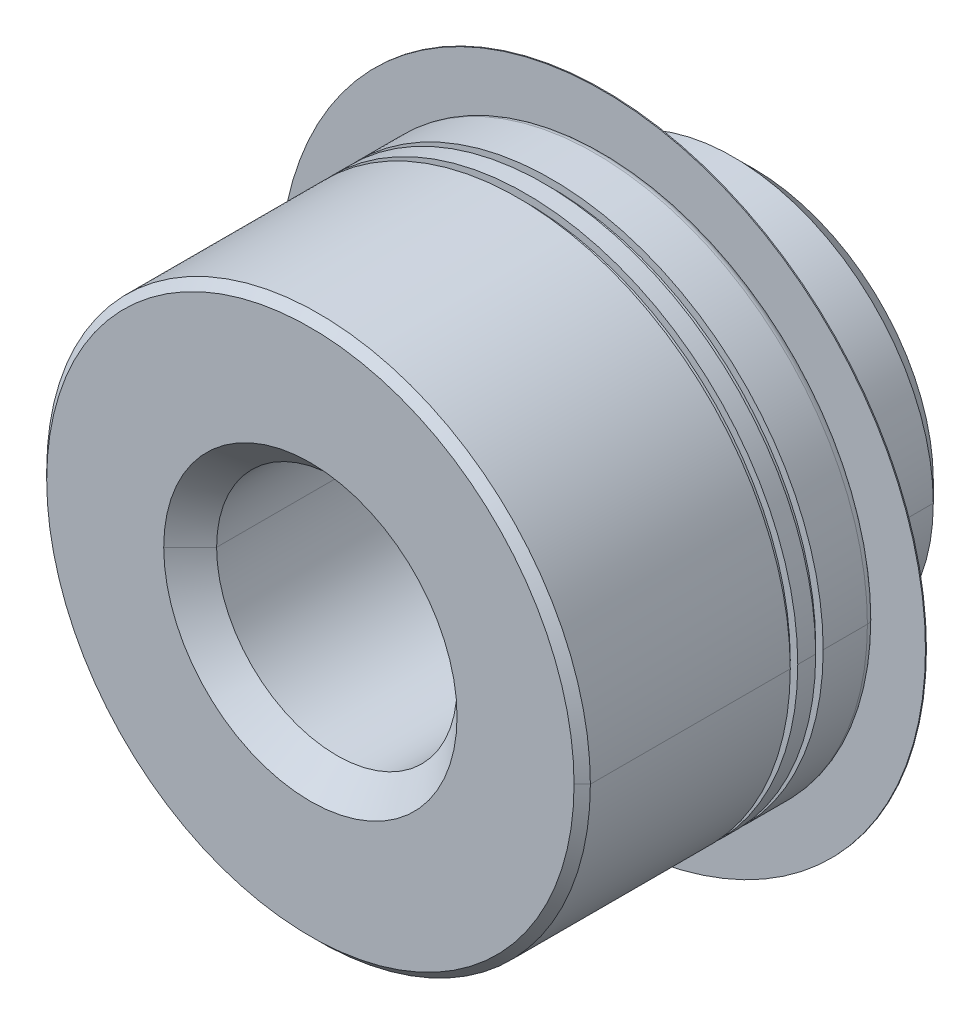
ISO-10303-21;
HEADER;
FILE_DESCRIPTION(('STEP AP214'),'2;1');
FILE_NAME('part.step','',(''),(''),'','','');
FILE_SCHEMA(('AUTOMOTIVE_DESIGN { 1 0 10303 214 1 1 1 1 }'));
ENDSEC;
DATA;
#1=APPLICATION_CONTEXT('core data for automotive mechanical design processes');
#2=APPLICATION_PROTOCOL_DEFINITION('international standard','automotive_design',2000,#1);
#3=PRODUCT_CONTEXT('',#1,'mechanical');
#4=PRODUCT('Part','Part','',(#3));
#5=PRODUCT_RELATED_PRODUCT_CATEGORY('part','',(#4));
#6=PRODUCT_DEFINITION_FORMATION('','',#4);
#7=PRODUCT_DEFINITION_CONTEXT('part definition',#1,'design');
#8=PRODUCT_DEFINITION('design','',#6,#7);
#9=PRODUCT_DEFINITION_SHAPE('','',#8);
#10=(LENGTH_UNIT() NAMED_UNIT(*) SI_UNIT(.MILLI.,.METRE.));
#11=(NAMED_UNIT(*) PLANE_ANGLE_UNIT() SI_UNIT($,.RADIAN.));
#12=(NAMED_UNIT(*) SI_UNIT($,.STERADIAN.) SOLID_ANGLE_UNIT());
#13=UNCERTAINTY_MEASURE_WITH_UNIT(LENGTH_MEASURE(1.E-05),#10,'distance_accuracy_value','');
#14=(GEOMETRIC_REPRESENTATION_CONTEXT(3) GLOBAL_UNCERTAINTY_ASSIGNED_CONTEXT((#13)) GLOBAL_UNIT_ASSIGNED_CONTEXT((#10,
#11,#12)) REPRESENTATION_CONTEXT('',''));
#15=CARTESIAN_POINT('',(0.,0.,0.));
#16=DIRECTION('',(0.,0.,1.));
#17=DIRECTION('',(1.,0.,0.));
#18=AXIS2_PLACEMENT_3D('',#15,#16,#17);
#19=CARTESIAN_POINT('',(0.,0.,0.0833999999999966));
#20=DIRECTION('',(0.,0.,-1.));
#21=DIRECTION('',(-1.,0.,0.));
#22=AXIS2_PLACEMENT_3D('',#19,#20,#21);
#23=TOROIDAL_SURFACE('',#22,2.69659999999978,0.0833999999999966);
#24=CARTESIAN_POINT('',(2.69659999999978,0.,0.0833999999999966));
#25=DIRECTION('',(0.,-1.,0.));
#26=DIRECTION('',(0.474795920221192,0.,-0.880095923261386));
#27=AXIS2_PLACEMENT_3D('',#24,#25,#26);
#28=CIRCLE('',#27,0.0833999999999966);
#29=CARTESIAN_POINT('',(2.73619797974702,0.,0.0100000000000006));
#30=VERTEX_POINT('',#29);
#31=CARTESIAN_POINT('',(2.77999999999904,0.,0.0833999999999966));
#32=VERTEX_POINT('',#31);
#33=EDGE_CURVE('E375',#30,#32,#28,.T.);
#34=ORIENTED_EDGE('',*,*,#33,.T.);
#35=CARTESIAN_POINT('',(0.,0.,0.0833999999999966));
#36=DIRECTION('',(0.,0.,1.));
#37=DIRECTION('',(-1.,0.,0.));
#38=AXIS2_PLACEMENT_3D('',#35,#36,#37);
#39=CIRCLE('',#38,2.77999999999904);
#40=CARTESIAN_POINT('',(-2.77999999999904,0.,0.0833999999999966));
#41=VERTEX_POINT('',#40);
#42=EDGE_CURVE('E264',#41,#32,#39,.T.);
#43=ORIENTED_EDGE('',*,*,#42,.F.);
#44=CARTESIAN_POINT('',(-2.69659999999978,0.,0.0833999999999966));
#45=DIRECTION('',(0.,-1.,0.));
#46=DIRECTION('',(-1.,0.,0.));
#47=AXIS2_PLACEMENT_3D('',#44,#45,#46);
#48=CIRCLE('',#47,0.0833999999999966);
#49=CARTESIAN_POINT('',(-2.73619797974702,0.,0.0100000000000006));
#50=VERTEX_POINT('',#49);
#51=EDGE_CURVE('E377',#41,#50,#48,.T.);
#52=ORIENTED_EDGE('',*,*,#51,.T.);
#53=CARTESIAN_POINT('',(0.,0.,0.0100000000000006));
#54=DIRECTION('',(0.,0.,-1.));
#55=DIRECTION('',(1.,0.,0.));
#56=AXIS2_PLACEMENT_3D('',#53,#54,#55);
#57=CIRCLE('',#56,2.73619797974702);
#58=EDGE_CURVE('E270',#30,#50,#57,.T.);
#59=ORIENTED_EDGE('',*,*,#58,.F.);
#60=EDGE_LOOP('',(#34,#43,#52,#59));
#61=FACE_BOUND('',#60,.T.);
#62=ADVANCED_FACE('F18',(#61),#23,.T.);
#63=CARTESIAN_POINT('',(2.74174999999932,0.,0.872099999999966));
#64=DIRECTION('',(0.,0.,-1.));
#65=DIRECTION('',(0.,-1.,0.));
#66=AXIS2_PLACEMENT_3D('',#63,#64,#65);
#67=PLANE('',#66);
#68=CARTESIAN_POINT('',(0.,0.,0.872099999999966));
#69=DIRECTION('',(0.,0.,-1.));
#70=DIRECTION('',(-1.,0.,0.));
#71=AXIS2_PLACEMENT_3D('',#68,#69,#70);
#72=CIRCLE('',#71,2.7034999999996);
#73=CARTESIAN_POINT('',(-2.7034999999996,0.,0.872099999999966));
#74=VERTEX_POINT('',#73);
#75=CARTESIAN_POINT('',(2.7034999999996,0.,0.872099999999966));
#76=VERTEX_POINT('',#75);
#77=EDGE_CURVE('E650',#74,#76,#72,.T.);
#78=ORIENTED_EDGE('',*,*,#77,.F.);
#79=CARTESIAN_POINT('',(0.,0.,0.872099999999966));
#80=DIRECTION('',(0.,0.,-1.));
#81=DIRECTION('',(1.,0.,0.));
#82=AXIS2_PLACEMENT_3D('',#79,#80,#81);
#83=CIRCLE('',#82,2.7034999999996);
#84=EDGE_CURVE('E462',#76,#74,#83,.T.);
#85=ORIENTED_EDGE('',*,*,#84,.F.);
#86=EDGE_LOOP('',(#78,#85));
#87=FACE_BOUND('',#86,.T.);
#88=CARTESIAN_POINT('',(0.,0.,0.872099999999966));
#89=DIRECTION('',(0.,0.,1.));
#90=DIRECTION('',(1.,0.,0.));
#91=AXIS2_PLACEMENT_3D('',#88,#89,#90);
#92=CIRCLE('',#91,2.77999999999904);
#93=CARTESIAN_POINT('',(2.77999999999904,0.,0.872099999999966));
#94=VERTEX_POINT('',#93);
#95=CARTESIAN_POINT('',(-2.77999999999904,0.,0.872099999999966));
#96=VERTEX_POINT('',#95);
#97=EDGE_CURVE('E355',#94,#96,#92,.T.);
#98=ORIENTED_EDGE('',*,*,#97,.F.);
#99=CARTESIAN_POINT('',(0.,0.,0.872099999999966));
#100=DIRECTION('',(0.,0.,1.));
#101=DIRECTION('',(-1.,0.,0.));
#102=AXIS2_PLACEMENT_3D('',#99,#100,#101);
#103=CIRCLE('',#102,2.77999999999904);
#104=EDGE_CURVE('E11',#96,#94,#103,.T.);
#105=ORIENTED_EDGE('',*,*,#104,.F.);
#106=EDGE_LOOP('',(#98,#105));
#107=FACE_BOUND('',#106,.T.);
#108=ADVANCED_FACE('F939',(#87,#107),#67,.T.);
#109=CARTESIAN_POINT('',(0.,0.,1.89435000000007));
#110=DIRECTION('',(0.,0.,-1.));
#111=DIRECTION('',(1.,0.,0.));
#112=AXIS2_PLACEMENT_3D('',#109,#110,#111);
#113=CYLINDRICAL_SURFACE('',#112,2.77999999999904);
#114=CARTESIAN_POINT('',(0.,0.,2.9165999999989));
#115=DIRECTION('',(0.,0.,-1.));
#116=DIRECTION('',(1.,0.,0.));
#117=AXIS2_PLACEMENT_3D('',#114,#115,#116);
#118=CIRCLE('',#117,2.77999999999904);
#119=CARTESIAN_POINT('',(2.77999999999904,0.,2.9165999999989));
#120=VERTEX_POINT('',#119);
#121=CARTESIAN_POINT('',(-2.77999999999904,0.,2.9165999999989));
#122=VERTEX_POINT('',#121);
#123=EDGE_CURVE('E244',#120,#122,#118,.T.);
#124=ORIENTED_EDGE('',*,*,#123,.T.);
#125=DIRECTION('',(0.,0.,1.));
#126=VECTOR('',#125,1.);
#127=CARTESIAN_POINT('',(-2.77999999999904,0.,0.872099999999966));
#128=LINE('',#127,#126);
#129=EDGE_CURVE('E359',#96,#122,#128,.T.);
#130=ORIENTED_EDGE('',*,*,#129,.F.);
#131=ORIENTED_EDGE('',*,*,#104,.T.);
#132=DIRECTION('',(0.,0.,-1.));
#133=VECTOR('',#132,1.);
#134=CARTESIAN_POINT('',(2.77999999999904,0.,2.9165999999989));
#135=LINE('',#134,#133);
#136=EDGE_CURVE('E29',#120,#94,#135,.T.);
#137=ORIENTED_EDGE('',*,*,#136,.F.);
#138=EDGE_LOOP('',(#124,#130,#131,#137));
#139=FACE_BOUND('',#138,.T.);
#140=ADVANCED_FACE('F935',(#139),#113,.T.);
#141=CARTESIAN_POINT('',(0.,0.,1.89435000000007));
#142=DIRECTION('',(0.,0.,-1.));
#143=DIRECTION('',(1.,0.,0.));
#144=AXIS2_PLACEMENT_3D('',#141,#142,#143);
#145=CYLINDRICAL_SURFACE('',#144,2.77999999999904);
#146=ORIENTED_EDGE('',*,*,#97,.T.);
#147=ORIENTED_EDGE('',*,*,#129,.T.);
#148=CARTESIAN_POINT('',(0.,0.,2.9165999999989));
#149=DIRECTION('',(0.,0.,-1.));
#150=DIRECTION('',(-1.,0.,0.));
#151=AXIS2_PLACEMENT_3D('',#148,#149,#150);
#152=CIRCLE('',#151,2.77999999999904);
#153=EDGE_CURVE('E243',#122,#120,#152,.T.);
#154=ORIENTED_EDGE('',*,*,#153,.T.);
#155=ORIENTED_EDGE('',*,*,#136,.T.);
#156=EDGE_LOOP('',(#146,#147,#154,#155));
#157=FACE_BOUND('',#156,.T.);
#158=ADVANCED_FACE('F882',(#157),#145,.T.);
#159=CARTESIAN_POINT('',(0.,0.,2.9582999999998));
#160=DIRECTION('',(0.,0.,-1.));
#161=DIRECTION('',(1.,0.,0.));
#162=AXIS2_PLACEMENT_3D('',#159,#160,#161);
#163=CONICAL_SURFACE('',#162,2.73830000000068,0.7853981633973);
#164=ORIENTED_EDGE('',*,*,#153,.F.);
#165=DIRECTION('',(0.707106781186598,0.,0.707106781186498));
#166=VECTOR('',#165,1.);
#167=CARTESIAN_POINT('',(-2.77999999999904,0.,2.9165999999989));
#168=LINE('',#167,#166);
#169=CARTESIAN_POINT('',(-2.69659999999978,0.,3.0000000000007));
#170=VERTEX_POINT('',#169);
#171=EDGE_CURVE('E87',#122,#170,#168,.T.);
#172=ORIENTED_EDGE('',*,*,#171,.T.);
#173=CARTESIAN_POINT('',(0.,0.,3.0000000000007));
#174=DIRECTION('',(0.,0.,-1.));
#175=DIRECTION('',(-1.,0.,0.));
#176=AXIS2_PLACEMENT_3D('',#173,#174,#175);
#177=CIRCLE('',#176,2.69659999999978);
#178=CARTESIAN_POINT('',(2.69659999999978,0.,3.0000000000007));
#179=VERTEX_POINT('',#178);
#180=EDGE_CURVE('E413',#170,#179,#177,.T.);
#181=ORIENTED_EDGE('',*,*,#180,.T.);
#182=DIRECTION('',(0.707106781186598,0.,-0.707106781186498));
#183=VECTOR('',#182,1.);
#184=CARTESIAN_POINT('',(2.69659999999978,0.,3.0000000000007));
#185=LINE('',#184,#183);
#186=EDGE_CURVE('E72',#179,#120,#185,.T.);
#187=ORIENTED_EDGE('',*,*,#186,.T.);
#188=EDGE_LOOP('',(#164,#172,#181,#187));
#189=FACE_BOUND('',#188,.T.);
#190=ADVANCED_FACE('F878',(#189),#163,.T.);
#191=CARTESIAN_POINT('',(0.,0.,2.9582999999998));
#192=DIRECTION('',(0.,0.,-1.));
#193=DIRECTION('',(1.,0.,0.));
#194=AXIS2_PLACEMENT_3D('',#191,#192,#193);
#195=CONICAL_SURFACE('',#194,2.73830000000068,0.7853981633973);
#196=CARTESIAN_POINT('',(0.,0.,3.0000000000007));
#197=DIRECTION('',(0.,0.,-1.));
#198=DIRECTION('',(1.,0.,0.));
#199=AXIS2_PLACEMENT_3D('',#196,#197,#198);
#200=CIRCLE('',#199,2.69659999999978);
#201=EDGE_CURVE('E416',#179,#170,#200,.T.);
#202=ORIENTED_EDGE('',*,*,#201,.T.);
#203=ORIENTED_EDGE('',*,*,#171,.F.);
#204=ORIENTED_EDGE('',*,*,#123,.F.);
#205=ORIENTED_EDGE('',*,*,#186,.F.);
#206=EDGE_LOOP('',(#202,#203,#204,#205));
#207=FACE_BOUND('',#206,.T.);
#208=ADVANCED_FACE('F850',(#207),#195,.T.);
#209=CARTESIAN_POINT('',(1.34829999999989,0.,3.0000000000007));
#210=DIRECTION('',(0.,0.,1.));
#211=DIRECTION('',(1.,0.,0.));
#212=AXIS2_PLACEMENT_3D('',#209,#210,#211);
#213=PLANE('',#212);
#214=CARTESIAN_POINT('',(0.,0.,3.0000000000007));
#215=DIRECTION('',(0.,0.,1.));
#216=DIRECTION('',(-1.,0.,0.));
#217=AXIS2_PLACEMENT_3D('',#214,#215,#216);
#218=CIRCLE('',#217,1.5000000000001);
#219=CARTESIAN_POINT('',(-1.5000000000001,0.,3.0000000000007));
#220=VERTEX_POINT('',#219);
#221=CARTESIAN_POINT('',(1.5000000000001,0.,3.0000000000007));
#222=VERTEX_POINT('',#221);
#223=EDGE_CURVE('E306',#220,#222,#218,.T.);
#224=ORIENTED_EDGE('',*,*,#223,.F.);
#225=CARTESIAN_POINT('',(0.,0.,3.0000000000007));
#226=DIRECTION('',(0.,0.,1.));
#227=DIRECTION('',(1.,0.,0.));
#228=AXIS2_PLACEMENT_3D('',#225,#226,#227);
#229=CIRCLE('',#228,1.5000000000001);
#230=EDGE_CURVE('E318',#222,#220,#229,.T.);
#231=ORIENTED_EDGE('',*,*,#230,.F.);
#232=EDGE_LOOP('',(#224,#231));
#233=FACE_BOUND('',#232,.T.);
#234=ORIENTED_EDGE('',*,*,#180,.F.);
#235=ORIENTED_EDGE('',*,*,#201,.F.);
#236=EDGE_LOOP('',(#234,#235));
#237=FACE_BOUND('',#236,.T.);
#238=ADVANCED_FACE('F846',(#233,#237),#213,.T.);
#239=CARTESIAN_POINT('',(0.,0.,2.86475000000086));
#240=DIRECTION('',(0.,0.,1.));
#241=DIRECTION('',(1.,0.,0.));
#242=AXIS2_PLACEMENT_3D('',#239,#240,#241);
#243=CONICAL_SURFACE('',#242,1.36475,0.7853981633973);
#244=ORIENTED_EDGE('',*,*,#230,.T.);
#245=DIRECTION('',(-0.707106781186548,0.,0.707106781186548));
#246=VECTOR('',#245,1.);
#247=CARTESIAN_POINT('',(-1.22949999999991,0.,2.72950000000102));
#248=LINE('',#247,#246);
#249=CARTESIAN_POINT('',(-1.22949999999991,0.,2.72950000000102));
#250=VERTEX_POINT('',#249);
#251=EDGE_CURVE('E310',#250,#220,#248,.T.);
#252=ORIENTED_EDGE('',*,*,#251,.F.);
#253=CARTESIAN_POINT('',(0.,0.,2.72950000000102));
#254=DIRECTION('',(0.,0.,1.));
#255=DIRECTION('',(1.,0.,0.));
#256=AXIS2_PLACEMENT_3D('',#253,#254,#255);
#257=CIRCLE('',#256,1.22949999999991);
#258=CARTESIAN_POINT('',(1.22949999999991,0.,2.72950000000102));
#259=VERTEX_POINT('',#258);
#260=EDGE_CURVE('E350',#259,#250,#257,.T.);
#261=ORIENTED_EDGE('',*,*,#260,.F.);
#262=DIRECTION('',(-0.707106781186548,0.,-0.707106781186548));
#263=VECTOR('',#262,1.);
#264=CARTESIAN_POINT('',(1.5000000000001,0.,3.0000000000007));
#265=LINE('',#264,#263);
#266=EDGE_CURVE('E309',#222,#259,#265,.T.);
#267=ORIENTED_EDGE('',*,*,#266,.F.);
#268=EDGE_LOOP('',(#244,#252,#261,#267));
#269=FACE_BOUND('',#268,.T.);
#270=ADVANCED_FACE('F815',(#269),#243,.F.);
#271=CARTESIAN_POINT('',(0.,0.,2.86475000000086));
#272=DIRECTION('',(0.,0.,1.));
#273=DIRECTION('',(1.,0.,0.));
#274=AXIS2_PLACEMENT_3D('',#271,#272,#273);
#275=CONICAL_SURFACE('',#274,1.36475,0.7853981633973);
#276=CARTESIAN_POINT('',(0.,0.,2.72950000000102));
#277=DIRECTION('',(0.,0.,1.));
#278=DIRECTION('',(-1.,0.,0.));
#279=AXIS2_PLACEMENT_3D('',#276,#277,#278);
#280=CIRCLE('',#279,1.22949999999991);
#281=EDGE_CURVE('E321',#250,#259,#280,.T.);
#282=ORIENTED_EDGE('',*,*,#281,.F.);
#283=ORIENTED_EDGE('',*,*,#251,.T.);
#284=ORIENTED_EDGE('',*,*,#223,.T.);
#285=ORIENTED_EDGE('',*,*,#266,.T.);
#286=EDGE_LOOP('',(#282,#283,#284,#285));
#287=FACE_BOUND('',#286,.T.);
#288=ADVANCED_FACE('F810',(#287),#275,.F.);
#289=CARTESIAN_POINT('',(0.,0.,0.735000000000108));
#290=DIRECTION('',(0.,0.,-1.));
#291=DIRECTION('',(1.,0.,0.));
#292=AXIS2_PLACEMENT_3D('',#289,#290,#291);
#293=CYLINDRICAL_SURFACE('',#292,1.22949999999991);
#294=CARTESIAN_POINT('',(0.,0.,-1.25950000000004));
#295=DIRECTION('',(0.,0.,-1.));
#296=DIRECTION('',(1.,0.,0.));
#297=AXIS2_PLACEMENT_3D('',#294,#295,#296);
#298=CIRCLE('',#297,1.22949999999991);
#299=CARTESIAN_POINT('',(1.22949999999991,0.,-1.25950000000004));
#300=VERTEX_POINT('',#299);
#301=CARTESIAN_POINT('',(-1.22949999999991,0.,-1.25950000000004));
#302=VERTEX_POINT('',#301);
#303=EDGE_CURVE('E249',#300,#302,#298,.T.);
#304=ORIENTED_EDGE('',*,*,#303,.T.);
#305=DIRECTION('',(0.,0.,1.));
#306=VECTOR('',#305,1.);
#307=CARTESIAN_POINT('',(-1.22949999999991,0.,-1.25950000000004));
#308=LINE('',#307,#306);
#309=EDGE_CURVE('E354',#302,#250,#308,.T.);
#310=ORIENTED_EDGE('',*,*,#309,.T.);
#311=ORIENTED_EDGE('',*,*,#281,.T.);
#312=DIRECTION('',(0.,0.,-1.));
#313=VECTOR('',#312,1.);
#314=CARTESIAN_POINT('',(1.22949999999991,0.,2.72950000000102));
#315=LINE('',#314,#313);
#316=EDGE_CURVE('E330',#259,#300,#315,.T.);
#317=ORIENTED_EDGE('',*,*,#316,.T.);
#318=EDGE_LOOP('',(#304,#310,#311,#317));
#319=FACE_BOUND('',#318,.T.);
#320=ADVANCED_FACE('F814',(#319),#293,.F.);
#321=CARTESIAN_POINT('',(0.,0.,0.735000000000108));
#322=DIRECTION('',(0.,0.,-1.));
#323=DIRECTION('',(1.,0.,0.));
#324=AXIS2_PLACEMENT_3D('',#321,#322,#323);
#325=CYLINDRICAL_SURFACE('',#324,1.22949999999991);
#326=ORIENTED_EDGE('',*,*,#260,.T.);
#327=ORIENTED_EDGE('',*,*,#309,.F.);
#328=CARTESIAN_POINT('',(0.,0.,-1.25950000000004));
#329=DIRECTION('',(0.,0.,-1.));
#330=DIRECTION('',(-1.,0.,0.));
#331=AXIS2_PLACEMENT_3D('',#328,#329,#330);
#332=CIRCLE('',#331,1.22949999999991);
#333=EDGE_CURVE('E304',#302,#300,#332,.T.);
#334=ORIENTED_EDGE('',*,*,#333,.T.);
#335=ORIENTED_EDGE('',*,*,#316,.F.);
#336=EDGE_LOOP('',(#326,#327,#334,#335));
#337=FACE_BOUND('',#336,.T.);
#338=ADVANCED_FACE('F923',(#337),#325,.F.);
#339=CARTESIAN_POINT('',(0.,0.,-1.39474999999988));
#340=DIRECTION('',(0.,0.,-1.));
#341=DIRECTION('',(1.,0.,0.));
#342=AXIS2_PLACEMENT_3D('',#339,#340,#341);
#343=CONICAL_SURFACE('',#342,1.36475,0.7853981633973);
#344=ORIENTED_EDGE('',*,*,#333,.F.);
#345=DIRECTION('',(0.707106781186548,0.,0.707106781186548));
#346=VECTOR('',#345,1.);
#347=CARTESIAN_POINT('',(-1.5000000000001,0.,-1.52999999999997));
#348=LINE('',#347,#346);
#349=CARTESIAN_POINT('',(-1.5000000000001,0.,-1.52999999999997));
#350=VERTEX_POINT('',#349);
#351=EDGE_CURVE('E245',#350,#302,#348,.T.);
#352=ORIENTED_EDGE('',*,*,#351,.F.);
#353=CARTESIAN_POINT('',(0.,0.,-1.52999999999997));
#354=DIRECTION('',(0.,0.,-1.));
#355=DIRECTION('',(-1.,0.,0.));
#356=AXIS2_PLACEMENT_3D('',#353,#354,#355);
#357=CIRCLE('',#356,1.5000000000001);
#358=CARTESIAN_POINT('',(1.5000000000001,0.,-1.52999999999997));
#359=VERTEX_POINT('',#358);
#360=EDGE_CURVE('E215',#350,#359,#357,.T.);
#361=ORIENTED_EDGE('',*,*,#360,.T.);
#362=DIRECTION('',(0.707106781186548,0.,-0.707106781186548));
#363=VECTOR('',#362,1.);
#364=CARTESIAN_POINT('',(1.22949999999991,0.,-1.25950000000004));
#365=LINE('',#364,#363);
#366=EDGE_CURVE('E291',#300,#359,#365,.T.);
#367=ORIENTED_EDGE('',*,*,#366,.F.);
#368=EDGE_LOOP('',(#344,#352,#361,#367));
#369=FACE_BOUND('',#368,.T.);
#370=ADVANCED_FACE('F927',(#369),#343,.F.);
#371=CARTESIAN_POINT('',(0.,0.,-1.39474999999988));
#372=DIRECTION('',(0.,0.,-1.));
#373=DIRECTION('',(1.,0.,0.));
#374=AXIS2_PLACEMENT_3D('',#371,#372,#373);
#375=CONICAL_SURFACE('',#374,1.36475,0.7853981633973);
#376=CARTESIAN_POINT('',(0.,0.,-1.52999999999997));
#377=DIRECTION('',(0.,0.,-1.));
#378=DIRECTION('',(1.,0.,0.));
#379=AXIS2_PLACEMENT_3D('',#376,#377,#378);
#380=CIRCLE('',#379,1.5000000000001);
#381=EDGE_CURVE('E250',#359,#350,#380,.T.);
#382=ORIENTED_EDGE('',*,*,#381,.T.);
#383=ORIENTED_EDGE('',*,*,#351,.T.);
#384=ORIENTED_EDGE('',*,*,#303,.F.);
#385=ORIENTED_EDGE('',*,*,#366,.T.);
#386=EDGE_LOOP('',(#382,#383,#384,#385));
#387=FACE_BOUND('',#386,.T.);
#388=ADVANCED_FACE('F788',(#387),#375,.F.);
#389=CARTESIAN_POINT('',(0.92025,0.,-1.52999999999997));
#390=DIRECTION('',(0.,0.,-1.));
#391=DIRECTION('',(0.,-1.,0.));
#392=AXIS2_PLACEMENT_3D('',#389,#390,#391);
#393=PLANE('',#392);
#394=ORIENTED_EDGE('',*,*,#360,.F.);
#395=ORIENTED_EDGE('',*,*,#381,.F.);
#396=EDGE_LOOP('',(#394,#395));
#397=FACE_BOUND('',#396,.T.);
#398=CARTESIAN_POINT('',(0.,0.,-1.52999999999997));
#399=DIRECTION('',(0.,0.,1.));
#400=DIRECTION('',(1.,0.,0.));
#401=AXIS2_PLACEMENT_3D('',#398,#399,#400);
#402=CIRCLE('',#401,1.8405);
#403=CARTESIAN_POINT('',(1.8405,0.,-1.52999999999997));
#404=VERTEX_POINT('',#403);
#405=CARTESIAN_POINT('',(-1.8405,0.,-1.52999999999997));
#406=VERTEX_POINT('',#405);
#407=EDGE_CURVE('E219',#404,#406,#402,.T.);
#408=ORIENTED_EDGE('',*,*,#407,.F.);
#409=CARTESIAN_POINT('',(0.,0.,-1.52999999999997));
#410=DIRECTION('',(0.,0.,1.));
#411=DIRECTION('',(-1.,0.,0.));
#412=AXIS2_PLACEMENT_3D('',#409,#410,#411);
#413=CIRCLE('',#412,1.8405);
#414=EDGE_CURVE('E204',#406,#404,#413,.T.);
#415=ORIENTED_EDGE('',*,*,#414,.F.);
#416=EDGE_LOOP('',(#408,#415));
#417=FACE_BOUND('',#416,.T.);
#418=ADVANCED_FACE('F225',(#397,#417),#393,.T.);
#419=CARTESIAN_POINT('',(0.,0.,-1.42775));
#420=DIRECTION('',(0.,0.,1.));
#421=DIRECTION('',(1.,0.,0.));
#422=AXIS2_PLACEMENT_3D('',#419,#420,#421);
#423=CONICAL_SURFACE('',#422,1.94274999999998,0.7853981633973);
#424=CARTESIAN_POINT('',(0.,0.,-1.32550000000003));
#425=DIRECTION('',(0.,0.,1.));
#426=DIRECTION('',(-1.,0.,0.));
#427=AXIS2_PLACEMENT_3D('',#424,#425,#426);
#428=CIRCLE('',#427,2.04499999999995);
#429=CARTESIAN_POINT('',(-2.04499999999995,0.,-1.32550000000003));
#430=VERTEX_POINT('',#429);
#431=CARTESIAN_POINT('',(2.04499999999995,0.,-1.32550000000003));
#432=VERTEX_POINT('',#431);
#433=EDGE_CURVE('E277',#430,#432,#428,.T.);
#434=ORIENTED_EDGE('',*,*,#433,.F.);
#435=DIRECTION('',(-0.707106781186548,0.,0.707106781186548));
#436=VECTOR('',#435,1.);
#437=CARTESIAN_POINT('',(-1.8405,0.,-1.52999999999997));
#438=LINE('',#437,#436);
#439=EDGE_CURVE('E210',#406,#430,#438,.T.);
#440=ORIENTED_EDGE('',*,*,#439,.F.);
#441=ORIENTED_EDGE('',*,*,#414,.T.);
#442=DIRECTION('',(-0.707106781186548,0.,-0.707106781186548));
#443=VECTOR('',#442,1.);
#444=CARTESIAN_POINT('',(2.04499999999995,0.,-1.32550000000003));
#445=LINE('',#444,#443);
#446=EDGE_CURVE('E208',#432,#404,#445,.T.);
#447=ORIENTED_EDGE('',*,*,#446,.F.);
#448=EDGE_LOOP('',(#434,#440,#441,#447));
#449=FACE_BOUND('',#448,.T.);
#450=ADVANCED_FACE('F207',(#449),#423,.T.);
#451=CARTESIAN_POINT('',(0.,0.,-1.42775));
#452=DIRECTION('',(0.,0.,1.));
#453=DIRECTION('',(1.,0.,0.));
#454=AXIS2_PLACEMENT_3D('',#451,#452,#453);
#455=CONICAL_SURFACE('',#454,1.94274999999998,0.7853981633973);
#456=ORIENTED_EDGE('',*,*,#407,.T.);
#457=ORIENTED_EDGE('',*,*,#439,.T.);
#458=CARTESIAN_POINT('',(0.,0.,-1.32550000000003));
#459=DIRECTION('',(0.,0.,1.));
#460=DIRECTION('',(1.,0.,0.));
#461=AXIS2_PLACEMENT_3D('',#458,#459,#460);
#462=CIRCLE('',#461,2.04499999999995);
#463=EDGE_CURVE('E221',#432,#430,#462,.T.);
#464=ORIENTED_EDGE('',*,*,#463,.F.);
#465=ORIENTED_EDGE('',*,*,#446,.T.);
#466=EDGE_LOOP('',(#456,#457,#464,#465));
#467=FACE_BOUND('',#466,.T.);
#468=ADVANCED_FACE('F218',(#467),#455,.T.);
#469=CARTESIAN_POINT('',(0.,0.,-0.662750000000016));
#470=DIRECTION('',(0.,0.,-1.));
#471=DIRECTION('',(1.,0.,0.));
#472=AXIS2_PLACEMENT_3D('',#469,#470,#471);
#473=CYLINDRICAL_SURFACE('',#472,2.04499999999995);
#474=ORIENTED_EDGE('',*,*,#463,.T.);
#475=DIRECTION('',(0.,0.,1.));
#476=VECTOR('',#475,1.);
#477=CARTESIAN_POINT('',(-2.04499999999995,0.,-1.32550000000003));
#478=LINE('',#477,#476);
#479=CARTESIAN_POINT('',(-2.04499999999995,0.,0.));
#480=VERTEX_POINT('',#479);
#481=EDGE_CURVE('E281',#430,#480,#478,.T.);
#482=ORIENTED_EDGE('',*,*,#481,.T.);
#483=CARTESIAN_POINT('',(0.,0.,0.));
#484=DIRECTION('',(0.,0.,-1.));
#485=DIRECTION('',(-1.,0.,0.));
#486=AXIS2_PLACEMENT_3D('',#483,#484,#485);
#487=CIRCLE('',#486,2.04499999999995);
#488=CARTESIAN_POINT('',(2.04499999999995,0.,0.));
#489=VERTEX_POINT('',#488);
#490=EDGE_CURVE('E298',#480,#489,#487,.T.);
#491=ORIENTED_EDGE('',*,*,#490,.T.);
#492=DIRECTION('',(0.,0.,-1.));
#493=VECTOR('',#492,1.);
#494=CARTESIAN_POINT('',(2.04499999999995,0.,0.));
#495=LINE('',#494,#493);
#496=EDGE_CURVE('E235',#489,#432,#495,.T.);
#497=ORIENTED_EDGE('',*,*,#496,.T.);
#498=EDGE_LOOP('',(#474,#482,#491,#497));
#499=FACE_BOUND('',#498,.T.);
#500=ADVANCED_FACE('F871',(#499),#473,.T.);
#501=CARTESIAN_POINT('',(0.,0.,-0.662750000000016));
#502=DIRECTION('',(0.,0.,-1.));
#503=DIRECTION('',(1.,0.,0.));
#504=AXIS2_PLACEMENT_3D('',#501,#502,#503);
#505=CYLINDRICAL_SURFACE('',#504,2.04499999999995);
#506=CARTESIAN_POINT('',(0.,0.,0.));
#507=DIRECTION('',(0.,0.,-1.));
#508=DIRECTION('',(1.,0.,0.));
#509=AXIS2_PLACEMENT_3D('',#506,#507,#508);
#510=CIRCLE('',#509,2.04499999999995);
#511=EDGE_CURVE('E349',#489,#480,#510,.T.);
#512=ORIENTED_EDGE('',*,*,#511,.T.);
#513=ORIENTED_EDGE('',*,*,#481,.F.);
#514=ORIENTED_EDGE('',*,*,#433,.T.);
#515=ORIENTED_EDGE('',*,*,#496,.F.);
#516=EDGE_LOOP('',(#512,#513,#514,#515));
#517=FACE_BOUND('',#516,.T.);
#518=ADVANCED_FACE('F838',(#517),#505,.T.);
#519=CARTESIAN_POINT('',(1.01509902017814E-05,0.,0.));
#520=DIRECTION('',(0.,0.,1.));
#521=DIRECTION('',(1.,0.,0.));
#522=AXIS2_PLACEMENT_3D('',#519,#520,#521);
#523=CYLINDRICAL_SURFACE('',#522,3.30037870247806);
#524=DIRECTION('',(0.,0.,1.));
#525=VECTOR('',#524,1.);
#526=CARTESIAN_POINT('',(3.30038885346868,0.,0.));
#527=LINE('',#526,#525);
#528=CARTESIAN_POINT('',(3.30038885346868,0.,0.));
#529=VERTEX_POINT('',#528);
#530=CARTESIAN_POINT('',(3.30038885346868,0.,0.0100000000000006));
#531=VERTEX_POINT('',#530);
#532=EDGE_CURVE('E337',#529,#531,#527,.T.);
#533=ORIENTED_EDGE('',*,*,#532,.T.);
#534=CARTESIAN_POINT('',(1.01509902017814E-05,0.,0.0100000000000006));
#535=DIRECTION('',(0.,0.,1.));
#536=DIRECTION('',(-1.,0.,0.));
#537=AXIS2_PLACEMENT_3D('',#534,#535,#536);
#538=CIRCLE('',#537,3.30037870247806);
#539=CARTESIAN_POINT('',(-3.30036855148744,0.,0.0100000000000006));
#540=VERTEX_POINT('',#539);
#541=EDGE_CURVE('E271',#540,#531,#538,.T.);
#542=ORIENTED_EDGE('',*,*,#541,.F.);
#543=DIRECTION('',(0.,0.,1.));
#544=VECTOR('',#543,1.);
#545=CARTESIAN_POINT('',(-3.30036855148744,0.,0.));
#546=LINE('',#545,#544);
#547=CARTESIAN_POINT('',(-3.30036855148744,0.,0.));
#548=VERTEX_POINT('',#547);
#549=EDGE_CURVE('E284',#548,#540,#546,.T.);
#550=ORIENTED_EDGE('',*,*,#549,.F.);
#551=CARTESIAN_POINT('',(1.01509902017814E-05,0.,0.));
#552=DIRECTION('',(0.,0.,1.));
#553=DIRECTION('',(-1.,0.,0.));
#554=AXIS2_PLACEMENT_3D('',#551,#552,#553);
#555=CIRCLE('',#554,3.30037870247806);
#556=EDGE_CURVE('E296',#548,#529,#555,.T.);
#557=ORIENTED_EDGE('',*,*,#556,.T.);
#558=EDGE_LOOP('',(#533,#542,#550,#557));
#559=FACE_BOUND('',#558,.T.);
#560=ADVANCED_FACE('F833',(#559),#523,.T.);
#561=CARTESIAN_POINT('',(2.37080000000012,0.,0.));
#562=DIRECTION('',(0.,0.,-1.));
#563=DIRECTION('',(0.,-1.,0.));
#564=AXIS2_PLACEMENT_3D('',#561,#562,#563);
#565=PLANE('',#564);
#566=ORIENTED_EDGE('',*,*,#490,.F.);
#567=ORIENTED_EDGE('',*,*,#511,.F.);
#568=EDGE_LOOP('',(#566,#567));
#569=FACE_BOUND('',#568,.T.);
#570=ORIENTED_EDGE('',*,*,#556,.F.);
#571=CARTESIAN_POINT('',(1.01509902017814E-05,0.,0.));
#572=DIRECTION('',(0.,0.,1.));
#573=DIRECTION('',(1.,0.,0.));
#574=AXIS2_PLACEMENT_3D('',#571,#572,#573);
#575=CIRCLE('',#574,3.30037870247806);
#576=EDGE_CURVE('E299',#529,#548,#575,.T.);
#577=ORIENTED_EDGE('',*,*,#576,.F.);
#578=EDGE_LOOP('',(#570,#577));
#579=FACE_BOUND('',#578,.T.);
#580=ADVANCED_FACE('F837',(#569,#579),#565,.T.);
#581=CARTESIAN_POINT('',(1.01509902017814E-05,0.,0.));
#582=DIRECTION('',(0.,0.,1.));
#583=DIRECTION('',(1.,0.,0.));
#584=AXIS2_PLACEMENT_3D('',#581,#582,#583);
#585=CYLINDRICAL_SURFACE('',#584,3.30037870247806);
#586=ORIENTED_EDGE('',*,*,#549,.T.);
#587=CARTESIAN_POINT('',(1.01509902017814E-05,0.,0.0100000000000006));
#588=DIRECTION('',(0.,0.,1.));
#589=DIRECTION('',(1.,0.,0.));
#590=AXIS2_PLACEMENT_3D('',#587,#588,#589);
#591=CIRCLE('',#590,3.30037870247806);
#592=EDGE_CURVE('E266',#531,#540,#591,.T.);
#593=ORIENTED_EDGE('',*,*,#592,.F.);
#594=ORIENTED_EDGE('',*,*,#532,.F.);
#595=ORIENTED_EDGE('',*,*,#576,.T.);
#596=EDGE_LOOP('',(#586,#593,#594,#595));
#597=FACE_BOUND('',#596,.T.);
#598=ADVANCED_FACE('F977',(#597),#585,.T.);
#599=CARTESIAN_POINT('',(0.,0.,0.0100000000000006));
#600=DIRECTION('',(0.,0.,1.));
#601=DIRECTION('',(1.,0.,0.));
#602=AXIS2_PLACEMENT_3D('',#599,#600,#601);
#603=PLANE('',#602);
#604=ORIENTED_EDGE('',*,*,#58,.T.);
#605=CARTESIAN_POINT('',(0.,0.,0.0100000000000006));
#606=DIRECTION('',(0.,0.,-1.));
#607=DIRECTION('',(-1.,0.,0.));
#608=AXIS2_PLACEMENT_3D('',#605,#606,#607);
#609=CIRCLE('',#608,2.73619797974702);
#610=EDGE_CURVE('E376',#50,#30,#609,.T.);
#611=ORIENTED_EDGE('',*,*,#610,.T.);
#612=EDGE_LOOP('',(#604,#611));
#613=FACE_BOUND('',#612,.T.);
#614=ORIENTED_EDGE('',*,*,#541,.T.);
#615=ORIENTED_EDGE('',*,*,#592,.T.);
#616=EDGE_LOOP('',(#614,#615));
#617=FACE_BOUND('',#616,.T.);
#618=ADVANCED_FACE('F906',(#613,#617),#603,.T.);
#619=CARTESIAN_POINT('',(0.,0.,0.0833999999999966));
#620=DIRECTION('',(0.,0.,-1.));
#621=DIRECTION('',(-1.,0.,0.));
#622=AXIS2_PLACEMENT_3D('',#619,#620,#621);
#623=TOROIDAL_SURFACE('',#622,2.69659999999978,0.0833999999999966);
#624=ORIENTED_EDGE('',*,*,#51,.F.);
#625=CARTESIAN_POINT('',(0.,0.,0.0833999999999966));
#626=DIRECTION('',(0.,0.,1.));
#627=DIRECTION('',(1.,0.,0.));
#628=AXIS2_PLACEMENT_3D('',#625,#626,#627);
#629=CIRCLE('',#628,2.77999999999904);
#630=EDGE_CURVE('E276',#32,#41,#629,.T.);
#631=ORIENTED_EDGE('',*,*,#630,.F.);
#632=ORIENTED_EDGE('',*,*,#33,.F.);
#633=ORIENTED_EDGE('',*,*,#610,.F.);
#634=EDGE_LOOP('',(#624,#631,#632,#633));
#635=FACE_BOUND('',#634,.T.);
#636=ADVANCED_FACE('F902',(#635),#623,.T.);
#637=CARTESIAN_POINT('',(0.,0.,0.309449999999956));
#638=DIRECTION('',(0.,0.,-1.));
#639=DIRECTION('',(1.,0.,0.));
#640=AXIS2_PLACEMENT_3D('',#637,#638,#639);
#641=CYLINDRICAL_SURFACE('',#640,2.77999999999904);
#642=ORIENTED_EDGE('',*,*,#630,.T.);
#643=DIRECTION('',(0.,0.,1.));
#644=VECTOR('',#643,1.);
#645=CARTESIAN_POINT('',(-2.77999999999904,0.,0.0833999999999966));
#646=LINE('',#645,#644);
#647=CARTESIAN_POINT('',(-2.77999999999904,0.,0.53549999999989));
#648=VERTEX_POINT('',#647);
#649=EDGE_CURVE('E260',#41,#648,#646,.T.);
#650=ORIENTED_EDGE('',*,*,#649,.T.);
#651=CARTESIAN_POINT('',(0.,0.,0.53549999999989));
#652=DIRECTION('',(0.,0.,-1.));
#653=DIRECTION('',(-1.,0.,0.));
#654=AXIS2_PLACEMENT_3D('',#651,#652,#653);
#655=CIRCLE('',#654,2.77999999999904);
#656=CARTESIAN_POINT('',(2.77999999999904,0.,0.53549999999989));
#657=VERTEX_POINT('',#656);
#658=EDGE_CURVE('E402',#648,#657,#655,.T.);
#659=ORIENTED_EDGE('',*,*,#658,.T.);
#660=DIRECTION('',(0.,0.,-1.));
#661=VECTOR('',#660,1.);
#662=CARTESIAN_POINT('',(2.77999999999904,0.,0.53549999999989));
#663=LINE('',#662,#661);
#664=EDGE_CURVE('E272',#657,#32,#663,.T.);
#665=ORIENTED_EDGE('',*,*,#664,.T.);
#666=EDGE_LOOP('',(#642,#650,#659,#665));
#667=FACE_BOUND('',#666,.T.);
#668=ADVANCED_FACE('F480',(#667),#641,.T.);
#669=CARTESIAN_POINT('',(0.,0.,0.309449999999956));
#670=DIRECTION('',(0.,0.,-1.));
#671=DIRECTION('',(1.,0.,0.));
#672=AXIS2_PLACEMENT_3D('',#669,#670,#671);
#673=CYLINDRICAL_SURFACE('',#672,2.77999999999904);
#674=CARTESIAN_POINT('',(0.,0.,0.53549999999989));
#675=DIRECTION('',(0.,0.,-1.));
#676=DIRECTION('',(1.,0.,0.));
#677=AXIS2_PLACEMENT_3D('',#674,#675,#676);
#678=CIRCLE('',#677,2.77999999999904);
#679=EDGE_CURVE('E265',#657,#648,#678,.T.);
#680=ORIENTED_EDGE('',*,*,#679,.T.);
#681=ORIENTED_EDGE('',*,*,#649,.F.);
#682=ORIENTED_EDGE('',*,*,#42,.T.);
#683=ORIENTED_EDGE('',*,*,#664,.F.);
#684=EDGE_LOOP('',(#680,#681,#682,#683));
#685=FACE_BOUND('',#684,.T.);
#686=ADVANCED_FACE('F473',(#685),#673,.T.);
#687=CARTESIAN_POINT('',(2.74174999999932,0.,0.53549999999989));
#688=DIRECTION('',(0.,0.,1.));
#689=DIRECTION('',(1.,0.,0.));
#690=AXIS2_PLACEMENT_3D('',#687,#688,#689);
#691=PLANE('',#690);
#692=CARTESIAN_POINT('',(0.,0.,0.53549999999989));
#693=DIRECTION('',(0.,0.,1.));
#694=DIRECTION('',(1.,0.,0.));
#695=AXIS2_PLACEMENT_3D('',#692,#693,#694);
#696=CIRCLE('',#695,2.7034999999996);
#697=CARTESIAN_POINT('',(2.7034999999996,0.,0.53549999999989));
#698=VERTEX_POINT('',#697);
#699=CARTESIAN_POINT('',(-2.7034999999996,0.,0.53549999999989));
#700=VERTEX_POINT('',#699);
#701=EDGE_CURVE('E406',#698,#700,#696,.T.);
#702=ORIENTED_EDGE('',*,*,#701,.F.);
#703=CARTESIAN_POINT('',(0.,0.,0.53549999999989));
#704=DIRECTION('',(0.,0.,1.));
#705=DIRECTION('',(-1.,0.,0.));
#706=AXIS2_PLACEMENT_3D('',#703,#704,#705);
#707=CIRCLE('',#706,2.7034999999996);
#708=EDGE_CURVE('E422',#700,#698,#707,.T.);
#709=ORIENTED_EDGE('',*,*,#708,.F.);
#710=EDGE_LOOP('',(#702,#709));
#711=FACE_BOUND('',#710,.T.);
#712=ORIENTED_EDGE('',*,*,#658,.F.);
#713=ORIENTED_EDGE('',*,*,#679,.F.);
#714=EDGE_LOOP('',(#712,#713));
#715=FACE_BOUND('',#714,.T.);
#716=ADVANCED_FACE('F478',(#711,#715),#691,.T.);
#717=CARTESIAN_POINT('',(0.,0.,0.573750000000118));
#718=DIRECTION('',(0.,0.,-1.));
#719=DIRECTION('',(1.,0.,0.));
#720=AXIS2_PLACEMENT_3D('',#717,#718,#719);
#721=CYLINDRICAL_SURFACE('',#720,2.7034999999996);
#722=ORIENTED_EDGE('',*,*,#701,.T.);
#723=DIRECTION('',(0.,0.,1.));
#724=VECTOR('',#723,1.);
#725=CARTESIAN_POINT('',(-2.7034999999996,0.,0.53549999999989));
#726=LINE('',#725,#724);
#727=CARTESIAN_POINT('',(-2.7034999999996,0.,0.612000000000092));
#728=VERTEX_POINT('',#727);
#729=EDGE_CURVE('E345',#700,#728,#726,.T.);
#730=ORIENTED_EDGE('',*,*,#729,.T.);
#731=CARTESIAN_POINT('',(0.,0.,0.612000000000092));
#732=DIRECTION('',(0.,0.,-1.));
#733=DIRECTION('',(-1.,0.,0.));
#734=AXIS2_PLACEMENT_3D('',#731,#732,#733);
#735=CIRCLE('',#734,2.7034999999996);
#736=CARTESIAN_POINT('',(2.7034999999996,0.,0.612000000000092));
#737=VERTEX_POINT('',#736);
#738=EDGE_CURVE('E295',#728,#737,#735,.T.);
#739=ORIENTED_EDGE('',*,*,#738,.T.);
#740=DIRECTION('',(0.,0.,-1.));
#741=VECTOR('',#740,1.);
#742=CARTESIAN_POINT('',(2.7034999999996,0.,0.612000000000092));
#743=LINE('',#742,#741);
#744=EDGE_CURVE('E409',#737,#698,#743,.T.);
#745=ORIENTED_EDGE('',*,*,#744,.T.);
#746=EDGE_LOOP('',(#722,#730,#739,#745));
#747=FACE_BOUND('',#746,.T.);
#748=ADVANCED_FACE('F894',(#747),#721,.T.);
#749=CARTESIAN_POINT('',(0.,0.,0.573750000000118));
#750=DIRECTION('',(0.,0.,-1.));
#751=DIRECTION('',(1.,0.,0.));
#752=AXIS2_PLACEMENT_3D('',#749,#750,#751);
#753=CYLINDRICAL_SURFACE('',#752,2.7034999999996);
#754=CARTESIAN_POINT('',(0.,0.,0.612000000000092));
#755=DIRECTION('',(0.,0.,-1.));
#756=DIRECTION('',(1.,0.,0.));
#757=AXIS2_PLACEMENT_3D('',#754,#755,#756);
#758=CIRCLE('',#757,2.7034999999996);
#759=EDGE_CURVE('E341',#737,#728,#758,.T.);
#760=ORIENTED_EDGE('',*,*,#759,.T.);
#761=ORIENTED_EDGE('',*,*,#729,.F.);
#762=ORIENTED_EDGE('',*,*,#708,.T.);
#763=ORIENTED_EDGE('',*,*,#744,.F.);
#764=EDGE_LOOP('',(#760,#761,#762,#763));
#765=FACE_BOUND('',#764,.T.);
#766=ADVANCED_FACE('F889',(#765),#753,.T.);
#767=CARTESIAN_POINT('',(2.74174999999932,0.,0.612000000000092));
#768=DIRECTION('',(0.,0.,-1.));
#769=DIRECTION('',(0.,-1.,0.));
#770=AXIS2_PLACEMENT_3D('',#767,#768,#769);
#771=PLANE('',#770);
#772=ORIENTED_EDGE('',*,*,#738,.F.);
#773=ORIENTED_EDGE('',*,*,#759,.F.);
#774=EDGE_LOOP('',(#772,#773));
#775=FACE_BOUND('',#774,.T.);
#776=CARTESIAN_POINT('',(0.,0.,0.612000000000092));
#777=DIRECTION('',(0.,0.,1.));
#778=DIRECTION('',(1.,0.,0.));
#779=AXIS2_PLACEMENT_3D('',#776,#777,#778);
#780=CIRCLE('',#779,2.77999999999904);
#781=CARTESIAN_POINT('',(2.77999999999904,0.,0.612000000000092));
#782=VERTEX_POINT('',#781);
#783=CARTESIAN_POINT('',(-2.77999999999904,0.,0.612000000000092));
#784=VERTEX_POINT('',#783);
#785=EDGE_CURVE('E292',#782,#784,#780,.T.);
#786=ORIENTED_EDGE('',*,*,#785,.F.);
#787=CARTESIAN_POINT('',(0.,0.,0.612000000000092));
#788=DIRECTION('',(0.,0.,1.));
#789=DIRECTION('',(-1.,0.,0.));
#790=AXIS2_PLACEMENT_3D('',#787,#788,#789);
#791=CIRCLE('',#790,2.77999999999904);
#792=EDGE_CURVE('E254',#784,#782,#791,.T.);
#793=ORIENTED_EDGE('',*,*,#792,.F.);
#794=EDGE_LOOP('',(#786,#793));
#795=FACE_BOUND('',#794,.T.);
#796=ADVANCED_FACE('F893',(#775,#795),#771,.T.);
#797=CARTESIAN_POINT('',(0.,0.,0.703799999999928));
#798=DIRECTION('',(0.,0.,-1.));
#799=DIRECTION('',(1.,0.,0.));
#800=AXIS2_PLACEMENT_3D('',#797,#798,#799);
#801=CYLINDRICAL_SURFACE('',#800,2.77999999999904);
#802=ORIENTED_EDGE('',*,*,#785,.T.);
#803=DIRECTION('',(0.,0.,1.));
#804=VECTOR('',#803,1.);
#805=CARTESIAN_POINT('',(-2.77999999999904,0.,0.612000000000092));
#806=LINE('',#805,#804);
#807=CARTESIAN_POINT('',(-2.77999999999904,0.,0.795600000000018));
#808=VERTEX_POINT('',#807);
#809=EDGE_CURVE('E251',#784,#808,#806,.T.);
#810=ORIENTED_EDGE('',*,*,#809,.T.);
#811=CARTESIAN_POINT('',(0.,0.,0.795600000000018));
#812=DIRECTION('',(0.,0.,-1.));
#813=DIRECTION('',(-1.,0.,0.));
#814=AXIS2_PLACEMENT_3D('',#811,#812,#813);
#815=CIRCLE('',#814,2.77999999999904);
#816=CARTESIAN_POINT('',(2.77999999999904,0.,0.795600000000018));
#817=VERTEX_POINT('',#816);
#818=EDGE_CURVE('E440',#808,#817,#815,.T.);
#819=ORIENTED_EDGE('',*,*,#818,.T.);
#820=DIRECTION('',(0.,0.,-1.));
#821=VECTOR('',#820,1.);
#822=CARTESIAN_POINT('',(2.77999999999904,0.,0.795600000000018));
#823=LINE('',#822,#821);
#824=EDGE_CURVE('E22',#817,#782,#823,.T.);
#825=ORIENTED_EDGE('',*,*,#824,.T.);
#826=EDGE_LOOP('',(#802,#810,#819,#825));
#827=FACE_BOUND('',#826,.T.);
#828=ADVANCED_FACE('F966',(#827),#801,.T.);
#829=CARTESIAN_POINT('',(0.,0.,0.703799999999928));
#830=DIRECTION('',(0.,0.,-1.));
#831=DIRECTION('',(1.,0.,0.));
#832=AXIS2_PLACEMENT_3D('',#829,#830,#831);
#833=CYLINDRICAL_SURFACE('',#832,2.77999999999904);
#834=CARTESIAN_POINT('',(0.,0.,0.795600000000018));
#835=DIRECTION('',(0.,0.,-1.));
#836=DIRECTION('',(1.,0.,0.));
#837=AXIS2_PLACEMENT_3D('',#834,#835,#836);
#838=CIRCLE('',#837,2.77999999999904);
#839=EDGE_CURVE('E255',#817,#808,#838,.T.);
#840=ORIENTED_EDGE('',*,*,#839,.T.);
#841=ORIENTED_EDGE('',*,*,#809,.F.);
#842=ORIENTED_EDGE('',*,*,#792,.T.);
#843=ORIENTED_EDGE('',*,*,#824,.F.);
#844=EDGE_LOOP('',(#840,#841,#842,#843));
#845=FACE_BOUND('',#844,.T.);
#846=ADVANCED_FACE('F20',(#845),#833,.T.);
#847=CARTESIAN_POINT('',(2.74174999999932,0.,0.795600000000018));
#848=DIRECTION('',(0.,0.,1.));
#849=DIRECTION('',(1.,0.,0.));
#850=AXIS2_PLACEMENT_3D('',#847,#848,#849);
#851=PLANE('',#850);
#852=CARTESIAN_POINT('',(0.,0.,0.795600000000018));
#853=DIRECTION('',(0.,0.,1.));
#854=DIRECTION('',(1.,0.,0.));
#855=AXIS2_PLACEMENT_3D('',#852,#853,#854);
#856=CIRCLE('',#855,2.7034999999996);
#857=CARTESIAN_POINT('',(2.7034999999996,0.,0.795600000000018));
#858=VERTEX_POINT('',#857);
#859=CARTESIAN_POINT('',(-2.7034999999996,0.,0.795600000000018));
#860=VERTEX_POINT('',#859);
#861=EDGE_CURVE('E256',#858,#860,#856,.T.);
#862=ORIENTED_EDGE('',*,*,#861,.F.);
#863=CARTESIAN_POINT('',(0.,0.,0.795600000000018));
#864=DIRECTION('',(0.,0.,1.));
#865=DIRECTION('',(-1.,0.,0.));
#866=AXIS2_PLACEMENT_3D('',#863,#864,#865);
#867=CIRCLE('',#866,2.7034999999996);
#868=EDGE_CURVE('E444',#860,#858,#867,.T.);
#869=ORIENTED_EDGE('',*,*,#868,.F.);
#870=EDGE_LOOP('',(#862,#869));
#871=FACE_BOUND('',#870,.T.);
#872=ORIENTED_EDGE('',*,*,#818,.F.);
#873=ORIENTED_EDGE('',*,*,#839,.F.);
#874=EDGE_LOOP('',(#872,#873));
#875=FACE_BOUND('',#874,.T.);
#876=ADVANCED_FACE('F798',(#871,#875),#851,.T.);
#877=CARTESIAN_POINT('',(0.,0.,0.83385));
#878=DIRECTION('',(0.,0.,-1.));
#879=DIRECTION('',(1.,0.,0.));
#880=AXIS2_PLACEMENT_3D('',#877,#878,#879);
#881=CYLINDRICAL_SURFACE('',#880,2.7034999999996);
#882=ORIENTED_EDGE('',*,*,#84,.T.);
#883=DIRECTION('',(0.,0.,1.));
#884=VECTOR('',#883,1.);
#885=CARTESIAN_POINT('',(-2.7034999999996,0.,0.795600000000018));
#886=LINE('',#885,#884);
#887=EDGE_CURVE('E238',#860,#74,#886,.T.);
#888=ORIENTED_EDGE('',*,*,#887,.F.);
#889=ORIENTED_EDGE('',*,*,#868,.T.);
#890=DIRECTION('',(0.,0.,-1.));
#891=VECTOR('',#890,1.);
#892=CARTESIAN_POINT('',(2.7034999999996,0.,0.872099999999966));
#893=LINE('',#892,#891);
#894=EDGE_CURVE('E1414',#76,#858,#893,.T.);
#895=ORIENTED_EDGE('',*,*,#894,.F.);
#896=EDGE_LOOP('',(#882,#888,#889,#895));
#897=FACE_BOUND('',#896,.T.);
#898=ADVANCED_FACE('F802',(#897),#881,.T.);
#899=CARTESIAN_POINT('',(0.,0.,0.83385));
#900=DIRECTION('',(0.,0.,-1.));
#901=DIRECTION('',(1.,0.,0.));
#902=AXIS2_PLACEMENT_3D('',#899,#900,#901);
#903=CYLINDRICAL_SURFACE('',#902,2.7034999999996);
#904=ORIENTED_EDGE('',*,*,#861,.T.);
#905=ORIENTED_EDGE('',*,*,#887,.T.);
#906=ORIENTED_EDGE('',*,*,#77,.T.);
#907=ORIENTED_EDGE('',*,*,#894,.T.);
#908=EDGE_LOOP('',(#904,#905,#906,#907));
#909=FACE_BOUND('',#908,.T.);
#910=ADVANCED_FACE('F825',(#909),#903,.T.);
#911=CLOSED_SHELL('',(#62,#108,#140,#158,#190,#208,#238,#270,#288,#320,#338,#370,#388,#418,#450,
#468,#500,#518,#560,#580,#598,#618,#636,#668,#686,#716,#748,#766,#796,#828,#846,#876,#898,#910));
#912=MANIFOLD_SOLID_BREP('B1',#911);
#913=ADVANCED_BREP_SHAPE_REPRESENTATION('',(#18,#912),#14);
#914=SHAPE_DEFINITION_REPRESENTATION(#9,#913);
ENDSEC;
END-ISO-10303-21;
